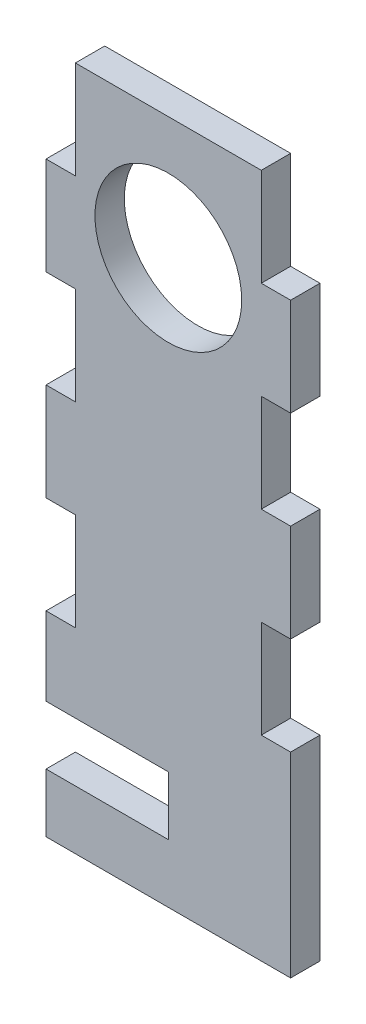
ISO-10303-21;
HEADER;
FILE_DESCRIPTION(('STEP AP214'),'2;1');
FILE_NAME('part.step','',(''),(''),'','','');
FILE_SCHEMA(('AUTOMOTIVE_DESIGN { 1 0 10303 214 1 1 1 1 }'));
ENDSEC;
DATA;
#1=APPLICATION_CONTEXT('core data for automotive mechanical design processes');
#2=APPLICATION_PROTOCOL_DEFINITION('international standard','automotive_design',2000,#1);
#3=PRODUCT_CONTEXT('',#1,'mechanical');
#4=PRODUCT('Part','Part','',(#3));
#5=PRODUCT_RELATED_PRODUCT_CATEGORY('part','',(#4));
#6=PRODUCT_DEFINITION_FORMATION('','',#4);
#7=PRODUCT_DEFINITION_CONTEXT('part definition',#1,'design');
#8=PRODUCT_DEFINITION('design','',#6,#7);
#9=PRODUCT_DEFINITION_SHAPE('','',#8);
#10=(LENGTH_UNIT() NAMED_UNIT(*) SI_UNIT(.MILLI.,.METRE.));
#11=(NAMED_UNIT(*) PLANE_ANGLE_UNIT() SI_UNIT($,.RADIAN.));
#12=(NAMED_UNIT(*) SI_UNIT($,.STERADIAN.) SOLID_ANGLE_UNIT());
#13=UNCERTAINTY_MEASURE_WITH_UNIT(LENGTH_MEASURE(1.E-05),#10,'distance_accuracy_value','');
#14=(GEOMETRIC_REPRESENTATION_CONTEXT(3) GLOBAL_UNCERTAINTY_ASSIGNED_CONTEXT((#13)) GLOBAL_UNIT_ASSIGNED_CONTEXT((#10,
#11,#12)) REPRESENTATION_CONTEXT('',''));
#15=CARTESIAN_POINT('',(0.,0.,0.));
#16=DIRECTION('',(0.,0.,1.));
#17=DIRECTION('',(1.,0.,0.));
#18=AXIS2_PLACEMENT_3D('',#15,#16,#17);
#19=CARTESIAN_POINT('',(-12.5,-35.,3.));
#20=DIRECTION('',(1.,0.,0.));
#21=DIRECTION('',(0.,0.,-1.));
#22=AXIS2_PLACEMENT_3D('',#19,#20,#21);
#23=PLANE('',#22);
#24=DIRECTION('',(0.,-1.,0.));
#25=VECTOR('',#24,1.);
#26=CARTESIAN_POINT('',(-12.5,-35.,0.));
#27=LINE('',#26,#25);
#28=CARTESIAN_POINT('',(-12.5,-15.,0.));
#29=VERTEX_POINT('',#28);
#30=CARTESIAN_POINT('',(-12.5,-23.,0.));
#31=VERTEX_POINT('',#30);
#32=EDGE_CURVE('E244',#29,#31,#27,.T.);
#33=ORIENTED_EDGE('',*,*,#32,.T.);
#34=DIRECTION('',(0.,0.,1.));
#35=VECTOR('',#34,1.);
#36=CARTESIAN_POINT('',(-12.5,-23.,0.));
#37=LINE('',#36,#35);
#38=CARTESIAN_POINT('',(-12.5,-23.,3.));
#39=VERTEX_POINT('',#38);
#40=EDGE_CURVE('E475',#31,#39,#37,.T.);
#41=ORIENTED_EDGE('',*,*,#40,.T.);
#42=DIRECTION('',(0.,-1.,0.));
#43=VECTOR('',#42,1.);
#44=CARTESIAN_POINT('',(-12.5,-35.,3.));
#45=LINE('',#44,#43);
#46=CARTESIAN_POINT('',(-12.5,-15.,3.));
#47=VERTEX_POINT('',#46);
#48=EDGE_CURVE('E277',#47,#39,#45,.T.);
#49=ORIENTED_EDGE('',*,*,#48,.F.);
#50=DIRECTION('',(0.,0.,1.));
#51=VECTOR('',#50,1.);
#52=CARTESIAN_POINT('',(-12.5,-15.,0.));
#53=LINE('',#52,#51);
#54=EDGE_CURVE('E331',#29,#47,#53,.T.);
#55=ORIENTED_EDGE('',*,*,#54,.F.);
#56=EDGE_LOOP('',(#33,#41,#49,#55));
#57=FACE_BOUND('',#56,.T.);
#58=ADVANCED_FACE('F35',(#57),#23,.F.);
#59=CARTESIAN_POINT('',(-12.5,25.,3.));
#60=VERTEX_POINT('',#59);
#61=CARTESIAN_POINT('',(-12.5,15.,3.));
#62=VERTEX_POINT('',#61);
#63=EDGE_CURVE('E270',#60,#62,#45,.T.);
#64=ORIENTED_EDGE('',*,*,#63,.F.);
#65=DIRECTION('',(0.,0.,1.));
#66=VECTOR('',#65,1.);
#67=CARTESIAN_POINT('',(-12.5,25.,0.));
#68=LINE('',#67,#66);
#69=CARTESIAN_POINT('',(-12.5,25.,0.));
#70=VERTEX_POINT('',#69);
#71=EDGE_CURVE('E391',#70,#60,#68,.T.);
#72=ORIENTED_EDGE('',*,*,#71,.F.);
#73=CARTESIAN_POINT('',(-12.5,15.,0.));
#74=VERTEX_POINT('',#73);
#75=EDGE_CURVE('E248',#70,#74,#27,.T.);
#76=ORIENTED_EDGE('',*,*,#75,.T.);
#77=DIRECTION('',(0.,0.,1.));
#78=VECTOR('',#77,1.);
#79=CARTESIAN_POINT('',(-12.5,15.,0.));
#80=LINE('',#79,#78);
#81=EDGE_CURVE('E418',#74,#62,#80,.T.);
#82=ORIENTED_EDGE('',*,*,#81,.T.);
#83=EDGE_LOOP('',(#64,#72,#76,#82));
#84=FACE_BOUND('',#83,.T.);
#85=ADVANCED_FACE('F509',(#84),#23,.F.);
#86=CARTESIAN_POINT('',(12.5,-35.,3.));
#87=DIRECTION('',(-1.,0.,0.));
#88=DIRECTION('',(0.,0.,1.));
#89=AXIS2_PLACEMENT_3D('',#86,#87,#88);
#90=PLANE('',#89);
#91=DIRECTION('',(0.,1.,0.));
#92=VECTOR('',#91,1.);
#93=CARTESIAN_POINT('',(12.5,-35.,0.));
#94=LINE('',#93,#92);
#95=CARTESIAN_POINT('',(12.5,-35.,0.));
#96=VERTEX_POINT('',#95);
#97=CARTESIAN_POINT('',(12.5,-15.,0.));
#98=VERTEX_POINT('',#97);
#99=EDGE_CURVE('E251',#96,#98,#94,.T.);
#100=ORIENTED_EDGE('',*,*,#99,.T.);
#101=DIRECTION('',(0.,0.,1.));
#102=VECTOR('',#101,1.);
#103=CARTESIAN_POINT('',(12.5,-15.,0.));
#104=LINE('',#103,#102);
#105=CARTESIAN_POINT('',(12.5,-15.,3.));
#106=VERTEX_POINT('',#105);
#107=EDGE_CURVE('E327',#98,#106,#104,.T.);
#108=ORIENTED_EDGE('',*,*,#107,.T.);
#109=DIRECTION('',(0.,1.,0.));
#110=VECTOR('',#109,1.);
#111=CARTESIAN_POINT('',(12.5,-35.,3.));
#112=LINE('',#111,#110);
#113=CARTESIAN_POINT('',(12.5,-35.,3.));
#114=VERTEX_POINT('',#113);
#115=EDGE_CURVE('E265',#114,#106,#112,.T.);
#116=ORIENTED_EDGE('',*,*,#115,.F.);
#117=DIRECTION('',(0.,0.,-1.));
#118=VECTOR('',#117,1.);
#119=CARTESIAN_POINT('',(12.5,-35.,3.));
#120=LINE('',#119,#118);
#121=EDGE_CURVE('E43',#114,#96,#120,.T.);
#122=ORIENTED_EDGE('',*,*,#121,.T.);
#123=EDGE_LOOP('',(#100,#108,#116,#122));
#124=FACE_BOUND('',#123,.T.);
#125=ADVANCED_FACE('F514',(#124),#90,.F.);
#126=CARTESIAN_POINT('',(-12.5,5.,3.));
#127=VERTEX_POINT('',#126);
#128=CARTESIAN_POINT('',(-12.5,-5.,3.));
#129=VERTEX_POINT('',#128);
#130=EDGE_CURVE('E275',#127,#129,#45,.T.);
#131=ORIENTED_EDGE('',*,*,#130,.F.);
#132=DIRECTION('',(0.,0.,1.));
#133=VECTOR('',#132,1.);
#134=CARTESIAN_POINT('',(-12.5,5.,0.));
#135=LINE('',#134,#133);
#136=CARTESIAN_POINT('',(-12.5,5.,0.));
#137=VERTEX_POINT('',#136);
#138=EDGE_CURVE('E429',#137,#127,#135,.T.);
#139=ORIENTED_EDGE('',*,*,#138,.F.);
#140=CARTESIAN_POINT('',(-12.5,-5.,0.));
#141=VERTEX_POINT('',#140);
#142=EDGE_CURVE('E247',#137,#141,#27,.T.);
#143=ORIENTED_EDGE('',*,*,#142,.T.);
#144=DIRECTION('',(0.,0.,1.));
#145=VECTOR('',#144,1.);
#146=CARTESIAN_POINT('',(-12.5,-5.,0.));
#147=LINE('',#146,#145);
#148=EDGE_CURVE('E322',#141,#129,#147,.T.);
#149=ORIENTED_EDGE('',*,*,#148,.T.);
#150=EDGE_LOOP('',(#131,#139,#143,#149));
#151=FACE_BOUND('',#150,.T.);
#152=ADVANCED_FACE('F329',(#151),#23,.F.);
#153=CARTESIAN_POINT('',(12.5,-5.,3.));
#154=VERTEX_POINT('',#153);
#155=CARTESIAN_POINT('',(12.5,5.,3.));
#156=VERTEX_POINT('',#155);
#157=EDGE_CURVE('E263',#154,#156,#112,.T.);
#158=ORIENTED_EDGE('',*,*,#157,.F.);
#159=DIRECTION('',(0.,0.,1.));
#160=VECTOR('',#159,1.);
#161=CARTESIAN_POINT('',(12.5,-5.,0.));
#162=LINE('',#161,#160);
#163=CARTESIAN_POINT('',(12.5,-5.,0.));
#164=VERTEX_POINT('',#163);
#165=EDGE_CURVE('E442',#164,#154,#162,.T.);
#166=ORIENTED_EDGE('',*,*,#165,.F.);
#167=CARTESIAN_POINT('',(12.5,5.,0.));
#168=VERTEX_POINT('',#167);
#169=EDGE_CURVE('E280',#164,#168,#94,.T.);
#170=ORIENTED_EDGE('',*,*,#169,.T.);
#171=DIRECTION('',(0.,0.,1.));
#172=VECTOR('',#171,1.);
#173=CARTESIAN_POINT('',(12.5,5.,0.));
#174=LINE('',#173,#172);
#175=EDGE_CURVE('E360',#168,#156,#174,.T.);
#176=ORIENTED_EDGE('',*,*,#175,.T.);
#177=EDGE_LOOP('',(#158,#166,#170,#176));
#178=FACE_BOUND('',#177,.T.);
#179=ADVANCED_FACE('F520',(#178),#90,.F.);
#180=CARTESIAN_POINT('',(12.5,15.,3.));
#181=VERTEX_POINT('',#180);
#182=CARTESIAN_POINT('',(12.5,25.,3.));
#183=VERTEX_POINT('',#182);
#184=EDGE_CURVE('E259',#181,#183,#112,.T.);
#185=ORIENTED_EDGE('',*,*,#184,.F.);
#186=DIRECTION('',(0.,0.,1.));
#187=VECTOR('',#186,1.);
#188=CARTESIAN_POINT('',(12.5,15.,0.));
#189=LINE('',#188,#187);
#190=CARTESIAN_POINT('',(12.5,15.,0.));
#191=VERTEX_POINT('',#190);
#192=EDGE_CURVE('E351',#191,#181,#189,.T.);
#193=ORIENTED_EDGE('',*,*,#192,.F.);
#194=CARTESIAN_POINT('',(12.5,25.,0.));
#195=VERTEX_POINT('',#194);
#196=EDGE_CURVE('E281',#191,#195,#94,.T.);
#197=ORIENTED_EDGE('',*,*,#196,.T.);
#198=DIRECTION('',(0.,0.,1.));
#199=VECTOR('',#198,1.);
#200=CARTESIAN_POINT('',(12.5,25.,0.));
#201=LINE('',#200,#199);
#202=EDGE_CURVE('E283',#195,#183,#201,.T.);
#203=ORIENTED_EDGE('',*,*,#202,.T.);
#204=EDGE_LOOP('',(#185,#193,#197,#203));
#205=FACE_BOUND('',#204,.T.);
#206=ADVANCED_FACE('F37',(#205),#90,.F.);
#207=CARTESIAN_POINT('',(-12.5,35.,3.));
#208=DIRECTION('',(0.,-1.,0.));
#209=DIRECTION('',(0.,0.,-1.));
#210=AXIS2_PLACEMENT_3D('',#207,#208,#209);
#211=PLANE('',#210);
#212=DIRECTION('',(-1.,0.,0.));
#213=VECTOR('',#212,1.);
#214=CARTESIAN_POINT('',(-12.5,35.,0.));
#215=LINE('',#214,#213);
#216=CARTESIAN_POINT('',(9.5,35.,0.));
#217=VERTEX_POINT('',#216);
#218=CARTESIAN_POINT('',(-9.5,35.,0.));
#219=VERTEX_POINT('',#218);
#220=EDGE_CURVE('E245',#217,#219,#215,.T.);
#221=ORIENTED_EDGE('',*,*,#220,.T.);
#222=DIRECTION('',(0.,0.,1.));
#223=VECTOR('',#222,1.);
#224=CARTESIAN_POINT('',(-9.5,35.,0.));
#225=LINE('',#224,#223);
#226=CARTESIAN_POINT('',(-9.5,35.,3.));
#227=VERTEX_POINT('',#226);
#228=EDGE_CURVE('E404',#219,#227,#225,.T.);
#229=ORIENTED_EDGE('',*,*,#228,.T.);
#230=DIRECTION('',(-1.,0.,0.));
#231=VECTOR('',#230,1.);
#232=CARTESIAN_POINT('',(-12.5,35.,3.));
#233=LINE('',#232,#231);
#234=CARTESIAN_POINT('',(9.5,35.,3.));
#235=VERTEX_POINT('',#234);
#236=EDGE_CURVE('E299',#235,#227,#233,.T.);
#237=ORIENTED_EDGE('',*,*,#236,.F.);
#238=DIRECTION('',(0.,0.,1.));
#239=VECTOR('',#238,1.);
#240=CARTESIAN_POINT('',(9.5,35.,0.));
#241=LINE('',#240,#239);
#242=EDGE_CURVE('E292',#217,#235,#241,.T.);
#243=ORIENTED_EDGE('',*,*,#242,.F.);
#244=EDGE_LOOP('',(#221,#229,#237,#243));
#245=FACE_BOUND('',#244,.T.);
#246=ADVANCED_FACE('F387',(#245),#211,.F.);
#247=CARTESIAN_POINT('',(-12.5,-29.,3.));
#248=VERTEX_POINT('',#247);
#249=CARTESIAN_POINT('',(-12.5,-35.,3.));
#250=VERTEX_POINT('',#249);
#251=EDGE_CURVE('E235',#248,#250,#45,.T.);
#252=ORIENTED_EDGE('',*,*,#251,.F.);
#253=DIRECTION('',(0.,0.,1.));
#254=VECTOR('',#253,1.);
#255=CARTESIAN_POINT('',(-12.5,-29.,0.));
#256=LINE('',#255,#254);
#257=CARTESIAN_POINT('',(-12.5,-29.,0.));
#258=VERTEX_POINT('',#257);
#259=EDGE_CURVE('E223',#258,#248,#256,.T.);
#260=ORIENTED_EDGE('',*,*,#259,.F.);
#261=CARTESIAN_POINT('',(-12.5,-35.,0.));
#262=VERTEX_POINT('',#261);
#263=EDGE_CURVE('E234',#258,#262,#27,.T.);
#264=ORIENTED_EDGE('',*,*,#263,.T.);
#265=DIRECTION('',(0.,0.,-1.));
#266=VECTOR('',#265,1.);
#267=CARTESIAN_POINT('',(-12.5,-35.,3.));
#268=LINE('',#267,#266);
#269=EDGE_CURVE('E11',#250,#262,#268,.T.);
#270=ORIENTED_EDGE('',*,*,#269,.F.);
#271=EDGE_LOOP('',(#252,#260,#264,#270));
#272=FACE_BOUND('',#271,.T.);
#273=ADVANCED_FACE('F232',(#272),#23,.F.);
#274=CARTESIAN_POINT('',(-12.5,-35.,3.));
#275=DIRECTION('',(0.,1.,0.));
#276=DIRECTION('',(0.,0.,1.));
#277=AXIS2_PLACEMENT_3D('',#274,#275,#276);
#278=PLANE('',#277);
#279=DIRECTION('',(1.,0.,0.));
#280=VECTOR('',#279,1.);
#281=CARTESIAN_POINT('',(-12.5,-35.,0.));
#282=LINE('',#281,#280);
#283=EDGE_CURVE('E243',#262,#96,#282,.T.);
#284=ORIENTED_EDGE('',*,*,#283,.T.);
#285=ORIENTED_EDGE('',*,*,#121,.F.);
#286=DIRECTION('',(1.,0.,0.));
#287=VECTOR('',#286,1.);
#288=CARTESIAN_POINT('',(-12.5,-35.,3.));
#289=LINE('',#288,#287);
#290=EDGE_CURVE('E266',#250,#114,#289,.T.);
#291=ORIENTED_EDGE('',*,*,#290,.F.);
#292=ORIENTED_EDGE('',*,*,#269,.T.);
#293=EDGE_LOOP('',(#284,#285,#291,#292));
#294=FACE_BOUND('',#293,.T.);
#295=ADVANCED_FACE('F499',(#294),#278,.F.);
#296=CARTESIAN_POINT('',(0.,0.,3.));
#297=DIRECTION('',(0.,0.,-1.));
#298=DIRECTION('',(-1.,0.,0.));
#299=AXIS2_PLACEMENT_3D('',#296,#297,#298);
#300=PLANE('',#299);
#301=CARTESIAN_POINT('',(0.,22.5,3.));
#302=DIRECTION('',(0.,0.,1.));
#303=DIRECTION('',(1.,0.,0.));
#304=AXIS2_PLACEMENT_3D('',#301,#302,#303);
#305=CIRCLE('',#304,7.5);
#306=CARTESIAN_POINT('',(7.5,22.5,3.));
#307=VERTEX_POINT('',#306);
#308=EDGE_CURVE('E478',#307,#307,#305,.T.);
#309=ORIENTED_EDGE('',*,*,#308,.F.);
#310=EDGE_LOOP('',(#309));
#311=FACE_BOUND('',#310,.T.);
#312=ORIENTED_EDGE('',*,*,#48,.T.);
#313=DIRECTION('',(-1.,0.,0.));
#314=VECTOR('',#313,1.);
#315=CARTESIAN_POINT('',(-12.5,-23.,3.));
#316=LINE('',#315,#314);
#317=CARTESIAN_POINT('',(0.,-23.,3.));
#318=VERTEX_POINT('',#317);
#319=EDGE_CURVE('E228',#318,#39,#316,.T.);
#320=ORIENTED_EDGE('',*,*,#319,.F.);
#321=DIRECTION('',(0.,1.,0.));
#322=VECTOR('',#321,1.);
#323=CARTESIAN_POINT('',(0.,-23.,3.));
#324=LINE('',#323,#322);
#325=CARTESIAN_POINT('',(0.,-29.,3.));
#326=VERTEX_POINT('',#325);
#327=EDGE_CURVE('E737',#326,#318,#324,.T.);
#328=ORIENTED_EDGE('',*,*,#327,.F.);
#329=DIRECTION('',(1.,0.,0.));
#330=VECTOR('',#329,1.);
#331=CARTESIAN_POINT('',(-12.5,-29.,3.));
#332=LINE('',#331,#330);
#333=EDGE_CURVE('E738',#248,#326,#332,.T.);
#334=ORIENTED_EDGE('',*,*,#333,.F.);
#335=ORIENTED_EDGE('',*,*,#251,.T.);
#336=ORIENTED_EDGE('',*,*,#290,.T.);
#337=ORIENTED_EDGE('',*,*,#115,.T.);
#338=DIRECTION('',(1.,0.,0.));
#339=VECTOR('',#338,1.);
#340=CARTESIAN_POINT('',(12.5,-15.,3.));
#341=LINE('',#340,#339);
#342=CARTESIAN_POINT('',(9.50000000000001,-15.,3.));
#343=VERTEX_POINT('',#342);
#344=EDGE_CURVE('E436',#343,#106,#341,.T.);
#345=ORIENTED_EDGE('',*,*,#344,.F.);
#346=DIRECTION('',(0.,-1.,0.));
#347=VECTOR('',#346,1.);
#348=CARTESIAN_POINT('',(9.50000000000001,-5.,3.));
#349=LINE('',#348,#347);
#350=CARTESIAN_POINT('',(9.50000000000001,-5.,3.));
#351=VERTEX_POINT('',#350);
#352=EDGE_CURVE('E445',#351,#343,#349,.T.);
#353=ORIENTED_EDGE('',*,*,#352,.F.);
#354=DIRECTION('',(-1.,0.,0.));
#355=VECTOR('',#354,1.);
#356=CARTESIAN_POINT('',(12.5,-5.,3.));
#357=LINE('',#356,#355);
#358=EDGE_CURVE('E426',#154,#351,#357,.T.);
#359=ORIENTED_EDGE('',*,*,#358,.F.);
#360=ORIENTED_EDGE('',*,*,#157,.T.);
#361=DIRECTION('',(1.,0.,0.));
#362=VECTOR('',#361,1.);
#363=CARTESIAN_POINT('',(12.5,5.,3.));
#364=LINE('',#363,#362);
#365=CARTESIAN_POINT('',(9.50000000000001,5.,3.));
#366=VERTEX_POINT('',#365);
#367=EDGE_CURVE('E345',#366,#156,#364,.T.);
#368=ORIENTED_EDGE('',*,*,#367,.F.);
#369=DIRECTION('',(0.,-1.,0.));
#370=VECTOR('',#369,1.);
#371=CARTESIAN_POINT('',(9.5,15.,3.));
#372=LINE('',#371,#370);
#373=CARTESIAN_POINT('',(9.5,15.,3.));
#374=VERTEX_POINT('',#373);
#375=EDGE_CURVE('E355',#374,#366,#372,.T.);
#376=ORIENTED_EDGE('',*,*,#375,.F.);
#377=DIRECTION('',(-1.,0.,0.));
#378=VECTOR('',#377,1.);
#379=CARTESIAN_POINT('',(12.5,15.,3.));
#380=LINE('',#379,#378);
#381=EDGE_CURVE('E352',#181,#374,#380,.T.);
#382=ORIENTED_EDGE('',*,*,#381,.F.);
#383=ORIENTED_EDGE('',*,*,#184,.T.);
#384=DIRECTION('',(1.,0.,0.));
#385=VECTOR('',#384,1.);
#386=CARTESIAN_POINT('',(12.5,25.,3.));
#387=LINE('',#386,#385);
#388=CARTESIAN_POINT('',(9.5,25.,3.));
#389=VERTEX_POINT('',#388);
#390=EDGE_CURVE('E295',#389,#183,#387,.T.);
#391=ORIENTED_EDGE('',*,*,#390,.F.);
#392=DIRECTION('',(0.,-1.,0.));
#393=VECTOR('',#392,1.);
#394=CARTESIAN_POINT('',(9.5,35.,3.));
#395=LINE('',#394,#393);
#396=EDGE_CURVE('E363',#235,#389,#395,.T.);
#397=ORIENTED_EDGE('',*,*,#396,.F.);
#398=ORIENTED_EDGE('',*,*,#236,.T.);
#399=DIRECTION('',(0.,1.,0.));
#400=VECTOR('',#399,1.);
#401=CARTESIAN_POINT('',(-9.5,35.,3.));
#402=LINE('',#401,#400);
#403=CARTESIAN_POINT('',(-9.5,25.,3.));
#404=VERTEX_POINT('',#403);
#405=EDGE_CURVE('E395',#404,#227,#402,.T.);
#406=ORIENTED_EDGE('',*,*,#405,.F.);
#407=DIRECTION('',(1.,0.,0.));
#408=VECTOR('',#407,1.);
#409=CARTESIAN_POINT('',(-12.5,25.,3.));
#410=LINE('',#409,#408);
#411=EDGE_CURVE('E399',#60,#404,#410,.T.);
#412=ORIENTED_EDGE('',*,*,#411,.F.);
#413=ORIENTED_EDGE('',*,*,#63,.T.);
#414=DIRECTION('',(-1.,0.,0.));
#415=VECTOR('',#414,1.);
#416=CARTESIAN_POINT('',(-12.5,15.,3.));
#417=LINE('',#416,#415);
#418=CARTESIAN_POINT('',(-9.5,15.,3.));
#419=VERTEX_POINT('',#418);
#420=EDGE_CURVE('E406',#419,#62,#417,.T.);
#421=ORIENTED_EDGE('',*,*,#420,.F.);
#422=DIRECTION('',(0.,1.,0.));
#423=VECTOR('',#422,1.);
#424=CARTESIAN_POINT('',(-9.5,15.,3.));
#425=LINE('',#424,#423);
#426=CARTESIAN_POINT('',(-9.50000000000001,5.,3.));
#427=VERTEX_POINT('',#426);
#428=EDGE_CURVE('E412',#427,#419,#425,.T.);
#429=ORIENTED_EDGE('',*,*,#428,.F.);
#430=DIRECTION('',(1.,0.,0.));
#431=VECTOR('',#430,1.);
#432=CARTESIAN_POINT('',(-12.5,5.,3.));
#433=LINE('',#432,#431);
#434=EDGE_CURVE('E314',#127,#427,#433,.T.);
#435=ORIENTED_EDGE('',*,*,#434,.F.);
#436=ORIENTED_EDGE('',*,*,#130,.T.);
#437=DIRECTION('',(-1.,0.,0.));
#438=VECTOR('',#437,1.);
#439=CARTESIAN_POINT('',(-12.5,-5.,3.));
#440=LINE('',#439,#438);
#441=CARTESIAN_POINT('',(-9.50000000000001,-5.,3.));
#442=VERTEX_POINT('',#441);
#443=EDGE_CURVE('E311',#442,#129,#440,.T.);
#444=ORIENTED_EDGE('',*,*,#443,.F.);
#445=DIRECTION('',(0.,1.,0.));
#446=VECTOR('',#445,1.);
#447=CARTESIAN_POINT('',(-9.50000000000001,-5.,3.));
#448=LINE('',#447,#446);
#449=CARTESIAN_POINT('',(-9.50000000000001,-15.,3.));
#450=VERTEX_POINT('',#449);
#451=EDGE_CURVE('E457',#450,#442,#448,.T.);
#452=ORIENTED_EDGE('',*,*,#451,.F.);
#453=DIRECTION('',(1.,0.,0.));
#454=VECTOR('',#453,1.);
#455=CARTESIAN_POINT('',(-12.5,-15.,3.));
#456=LINE('',#455,#454);
#457=EDGE_CURVE('E326',#47,#450,#456,.T.);
#458=ORIENTED_EDGE('',*,*,#457,.F.);
#459=EDGE_LOOP('',(#312,#320,#328,#334,#335,#336,#337,#345,#353,#359,#360,#368,#376,#382,#383,
#391,#397,#398,#406,#412,#413,#421,#429,#435,#436,#444,#452,#458));
#460=FACE_BOUND('',#459,.T.);
#461=ADVANCED_FACE('F309',(#311,#460),#300,.F.);
#462=CARTESIAN_POINT('',(0.,0.,0.));
#463=DIRECTION('',(0.,0.,-1.));
#464=DIRECTION('',(-1.,0.,0.));
#465=AXIS2_PLACEMENT_3D('',#462,#463,#464);
#466=PLANE('',#465);
#467=DIRECTION('',(-1.,0.,0.));
#468=VECTOR('',#467,1.);
#469=CARTESIAN_POINT('',(-12.5,-23.,0.));
#470=LINE('',#469,#468);
#471=CARTESIAN_POINT('',(0.,-23.,0.));
#472=VERTEX_POINT('',#471);
#473=EDGE_CURVE('E236',#472,#31,#470,.T.);
#474=ORIENTED_EDGE('',*,*,#473,.T.);
#475=ORIENTED_EDGE('',*,*,#32,.F.);
#476=DIRECTION('',(1.,0.,0.));
#477=VECTOR('',#476,1.);
#478=CARTESIAN_POINT('',(-12.5,-15.,0.));
#479=LINE('',#478,#477);
#480=CARTESIAN_POINT('',(-9.50000000000001,-15.,0.));
#481=VERTEX_POINT('',#480);
#482=EDGE_CURVE('E337',#29,#481,#479,.T.);
#483=ORIENTED_EDGE('',*,*,#482,.T.);
#484=DIRECTION('',(0.,1.,0.));
#485=VECTOR('',#484,1.);
#486=CARTESIAN_POINT('',(-9.50000000000001,-5.,0.));
#487=LINE('',#486,#485);
#488=CARTESIAN_POINT('',(-9.50000000000001,-5.,0.));
#489=VERTEX_POINT('',#488);
#490=EDGE_CURVE('E332',#481,#489,#487,.T.);
#491=ORIENTED_EDGE('',*,*,#490,.T.);
#492=DIRECTION('',(-1.,0.,0.));
#493=VECTOR('',#492,1.);
#494=CARTESIAN_POINT('',(-12.5,-5.,0.));
#495=LINE('',#494,#493);
#496=EDGE_CURVE('E455',#489,#141,#495,.T.);
#497=ORIENTED_EDGE('',*,*,#496,.T.);
#498=ORIENTED_EDGE('',*,*,#142,.F.);
#499=DIRECTION('',(1.,0.,0.));
#500=VECTOR('',#499,1.);
#501=CARTESIAN_POINT('',(-12.5,5.,0.));
#502=LINE('',#501,#500);
#503=CARTESIAN_POINT('',(-9.50000000000001,5.,0.));
#504=VERTEX_POINT('',#503);
#505=EDGE_CURVE('E411',#137,#504,#502,.T.);
#506=ORIENTED_EDGE('',*,*,#505,.T.);
#507=DIRECTION('',(0.,1.,0.));
#508=VECTOR('',#507,1.);
#509=CARTESIAN_POINT('',(-9.5,15.,0.));
#510=LINE('',#509,#508);
#511=CARTESIAN_POINT('',(-9.5,15.,0.));
#512=VERTEX_POINT('',#511);
#513=EDGE_CURVE('E415',#504,#512,#510,.T.);
#514=ORIENTED_EDGE('',*,*,#513,.T.);
#515=DIRECTION('',(-1.,0.,0.));
#516=VECTOR('',#515,1.);
#517=CARTESIAN_POINT('',(-12.5,15.,0.));
#518=LINE('',#517,#516);
#519=EDGE_CURVE('E408',#512,#74,#518,.T.);
#520=ORIENTED_EDGE('',*,*,#519,.T.);
#521=ORIENTED_EDGE('',*,*,#75,.F.);
#522=DIRECTION('',(1.,0.,0.));
#523=VECTOR('',#522,1.);
#524=CARTESIAN_POINT('',(-12.5,25.,0.));
#525=LINE('',#524,#523);
#526=CARTESIAN_POINT('',(-9.5,25.,0.));
#527=VERTEX_POINT('',#526);
#528=EDGE_CURVE('E390',#70,#527,#525,.T.);
#529=ORIENTED_EDGE('',*,*,#528,.T.);
#530=DIRECTION('',(0.,1.,0.));
#531=VECTOR('',#530,1.);
#532=CARTESIAN_POINT('',(-9.5,35.,0.));
#533=LINE('',#532,#531);
#534=EDGE_CURVE('E58',#527,#219,#533,.T.);
#535=ORIENTED_EDGE('',*,*,#534,.T.);
#536=ORIENTED_EDGE('',*,*,#220,.F.);
#537=DIRECTION('',(0.,-1.,0.));
#538=VECTOR('',#537,1.);
#539=CARTESIAN_POINT('',(9.5,35.,0.));
#540=LINE('',#539,#538);
#541=CARTESIAN_POINT('',(9.50000000000001,25.,0.));
#542=VERTEX_POINT('',#541);
#543=EDGE_CURVE('E369',#217,#542,#540,.T.);
#544=ORIENTED_EDGE('',*,*,#543,.T.);
#545=DIRECTION('',(1.,0.,0.));
#546=VECTOR('',#545,1.);
#547=CARTESIAN_POINT('',(12.5,25.,0.));
#548=LINE('',#547,#546);
#549=EDGE_CURVE('E298',#542,#195,#548,.T.);
#550=ORIENTED_EDGE('',*,*,#549,.T.);
#551=ORIENTED_EDGE('',*,*,#196,.F.);
#552=DIRECTION('',(-1.,0.,0.));
#553=VECTOR('',#552,1.);
#554=CARTESIAN_POINT('',(12.5,15.,0.));
#555=LINE('',#554,#553);
#556=CARTESIAN_POINT('',(9.5,15.,0.));
#557=VERTEX_POINT('',#556);
#558=EDGE_CURVE('E341',#191,#557,#555,.T.);
#559=ORIENTED_EDGE('',*,*,#558,.T.);
#560=DIRECTION('',(0.,-1.,0.));
#561=VECTOR('',#560,1.);
#562=CARTESIAN_POINT('',(9.5,15.,0.));
#563=LINE('',#562,#561);
#564=CARTESIAN_POINT('',(9.50000000000001,5.,0.));
#565=VERTEX_POINT('',#564);
#566=EDGE_CURVE('E344',#557,#565,#563,.T.);
#567=ORIENTED_EDGE('',*,*,#566,.T.);
#568=DIRECTION('',(1.,0.,0.));
#569=VECTOR('',#568,1.);
#570=CARTESIAN_POINT('',(12.5,5.,0.));
#571=LINE('',#570,#569);
#572=EDGE_CURVE('E348',#565,#168,#571,.T.);
#573=ORIENTED_EDGE('',*,*,#572,.T.);
#574=ORIENTED_EDGE('',*,*,#169,.F.);
#575=DIRECTION('',(-1.,0.,0.));
#576=VECTOR('',#575,1.);
#577=CARTESIAN_POINT('',(12.5,-5.,0.));
#578=LINE('',#577,#576);
#579=CARTESIAN_POINT('',(9.50000000000001,-5.,0.));
#580=VERTEX_POINT('',#579);
#581=EDGE_CURVE('E432',#164,#580,#578,.T.);
#582=ORIENTED_EDGE('',*,*,#581,.T.);
#583=DIRECTION('',(0.,-1.,0.));
#584=VECTOR('',#583,1.);
#585=CARTESIAN_POINT('',(9.50000000000001,-5.,0.));
#586=LINE('',#585,#584);
#587=CARTESIAN_POINT('',(9.50000000000001,-15.,0.));
#588=VERTEX_POINT('',#587);
#589=EDGE_CURVE('E435',#580,#588,#586,.T.);
#590=ORIENTED_EDGE('',*,*,#589,.T.);
#591=DIRECTION('',(1.,0.,0.));
#592=VECTOR('',#591,1.);
#593=CARTESIAN_POINT('',(12.5,-15.,0.));
#594=LINE('',#593,#592);
#595=EDGE_CURVE('E439',#588,#98,#594,.T.);
#596=ORIENTED_EDGE('',*,*,#595,.T.);
#597=ORIENTED_EDGE('',*,*,#99,.F.);
#598=ORIENTED_EDGE('',*,*,#283,.F.);
#599=ORIENTED_EDGE('',*,*,#263,.F.);
#600=DIRECTION('',(1.,0.,0.));
#601=VECTOR('',#600,1.);
#602=CARTESIAN_POINT('',(-12.5,-29.,0.));
#603=LINE('',#602,#601);
#604=CARTESIAN_POINT('',(0.,-29.,0.));
#605=VERTEX_POINT('',#604);
#606=EDGE_CURVE('E219',#258,#605,#603,.T.);
#607=ORIENTED_EDGE('',*,*,#606,.T.);
#608=DIRECTION('',(0.,1.,0.));
#609=VECTOR('',#608,1.);
#610=CARTESIAN_POINT('',(0.,-23.,0.));
#611=LINE('',#610,#609);
#612=EDGE_CURVE('E50',#605,#472,#611,.T.);
#613=ORIENTED_EDGE('',*,*,#612,.T.);
#614=EDGE_LOOP('',(#474,#475,#483,#491,#497,#498,#506,#514,#520,#521,#529,#535,#536,#544,#550,
#551,#559,#567,#573,#574,#582,#590,#596,#597,#598,#599,#607,#613));
#615=FACE_BOUND('',#614,.T.);
#616=CARTESIAN_POINT('',(0.,22.5,0.));
#617=DIRECTION('',(0.,0.,1.));
#618=DIRECTION('',(1.,0.,0.));
#619=AXIS2_PLACEMENT_3D('',#616,#617,#618);
#620=CIRCLE('',#619,7.5);
#621=CARTESIAN_POINT('',(7.5,22.5,0.));
#622=VERTEX_POINT('',#621);
#623=EDGE_CURVE('E402',#622,#622,#620,.T.);
#624=ORIENTED_EDGE('',*,*,#623,.T.);
#625=EDGE_LOOP('',(#624));
#626=FACE_BOUND('',#625,.T.);
#627=ADVANCED_FACE('F240',(#615,#626),#466,.T.);
#628=CARTESIAN_POINT('',(12.5,25.,0.));
#629=DIRECTION('',(0.,-1.,0.));
#630=DIRECTION('',(0.,0.,-1.));
#631=AXIS2_PLACEMENT_3D('',#628,#629,#630);
#632=PLANE('',#631);
#633=ORIENTED_EDGE('',*,*,#390,.T.);
#634=ORIENTED_EDGE('',*,*,#202,.F.);
#635=ORIENTED_EDGE('',*,*,#549,.F.);
#636=DIRECTION('',(0.,0.,1.));
#637=VECTOR('',#636,1.);
#638=CARTESIAN_POINT('',(9.5,25.,0.));
#639=LINE('',#638,#637);
#640=EDGE_CURVE('E289',#542,#389,#639,.T.);
#641=ORIENTED_EDGE('',*,*,#640,.T.);
#642=EDGE_LOOP('',(#633,#634,#635,#641));
#643=FACE_BOUND('',#642,.T.);
#644=ADVANCED_FACE('F379',(#643),#632,.F.);
#645=CARTESIAN_POINT('',(9.5,35.,0.));
#646=DIRECTION('',(-1.,0.,0.));
#647=DIRECTION('',(0.,-1.,0.));
#648=AXIS2_PLACEMENT_3D('',#645,#646,#647);
#649=PLANE('',#648);
#650=ORIENTED_EDGE('',*,*,#396,.T.);
#651=ORIENTED_EDGE('',*,*,#640,.F.);
#652=ORIENTED_EDGE('',*,*,#543,.F.);
#653=ORIENTED_EDGE('',*,*,#242,.T.);
#654=EDGE_LOOP('',(#650,#651,#652,#653));
#655=FACE_BOUND('',#654,.T.);
#656=ADVANCED_FACE('F384',(#655),#649,.F.);
#657=CARTESIAN_POINT('',(12.5,5.,0.));
#658=DIRECTION('',(0.,-1.,0.));
#659=DIRECTION('',(0.,0.,-1.));
#660=AXIS2_PLACEMENT_3D('',#657,#658,#659);
#661=PLANE('',#660);
#662=ORIENTED_EDGE('',*,*,#367,.T.);
#663=ORIENTED_EDGE('',*,*,#175,.F.);
#664=ORIENTED_EDGE('',*,*,#572,.F.);
#665=DIRECTION('',(0.,0.,1.));
#666=VECTOR('',#665,1.);
#667=CARTESIAN_POINT('',(9.50000000000001,5.,0.));
#668=LINE('',#667,#666);
#669=EDGE_CURVE('E364',#565,#366,#668,.T.);
#670=ORIENTED_EDGE('',*,*,#669,.T.);
#671=EDGE_LOOP('',(#662,#663,#664,#670));
#672=FACE_BOUND('',#671,.T.);
#673=ADVANCED_FACE('F571',(#672),#661,.F.);
#674=CARTESIAN_POINT('',(9.5,15.,0.));
#675=DIRECTION('',(-1.,0.,0.));
#676=DIRECTION('',(0.,-1.,0.));
#677=AXIS2_PLACEMENT_3D('',#674,#675,#676);
#678=PLANE('',#677);
#679=ORIENTED_EDGE('',*,*,#375,.T.);
#680=ORIENTED_EDGE('',*,*,#669,.F.);
#681=ORIENTED_EDGE('',*,*,#566,.F.);
#682=DIRECTION('',(0.,0.,1.));
#683=VECTOR('',#682,1.);
#684=CARTESIAN_POINT('',(9.5,15.,0.));
#685=LINE('',#684,#683);
#686=EDGE_CURVE('E366',#557,#374,#685,.T.);
#687=ORIENTED_EDGE('',*,*,#686,.T.);
#688=EDGE_LOOP('',(#679,#680,#681,#687));
#689=FACE_BOUND('',#688,.T.);
#690=ADVANCED_FACE('F579',(#689),#678,.F.);
#691=CARTESIAN_POINT('',(12.5,15.,0.));
#692=DIRECTION('',(0.,1.,0.));
#693=DIRECTION('',(0.,0.,1.));
#694=AXIS2_PLACEMENT_3D('',#691,#692,#693);
#695=PLANE('',#694);
#696=ORIENTED_EDGE('',*,*,#381,.T.);
#697=ORIENTED_EDGE('',*,*,#686,.F.);
#698=ORIENTED_EDGE('',*,*,#558,.F.);
#699=ORIENTED_EDGE('',*,*,#192,.T.);
#700=EDGE_LOOP('',(#696,#697,#698,#699));
#701=FACE_BOUND('',#700,.T.);
#702=ADVANCED_FACE('F589',(#701),#695,.F.);
#703=CARTESIAN_POINT('',(-12.5,-5.,0.));
#704=DIRECTION('',(0.,1.,0.));
#705=DIRECTION('',(0.,0.,1.));
#706=AXIS2_PLACEMENT_3D('',#703,#704,#705);
#707=PLANE('',#706);
#708=ORIENTED_EDGE('',*,*,#443,.T.);
#709=ORIENTED_EDGE('',*,*,#148,.F.);
#710=ORIENTED_EDGE('',*,*,#496,.F.);
#711=DIRECTION('',(0.,0.,1.));
#712=VECTOR('',#711,1.);
#713=CARTESIAN_POINT('',(-9.50000000000001,-5.,0.));
#714=LINE('',#713,#712);
#715=EDGE_CURVE('E324',#489,#442,#714,.T.);
#716=ORIENTED_EDGE('',*,*,#715,.T.);
#717=EDGE_LOOP('',(#708,#709,#710,#716));
#718=FACE_BOUND('',#717,.T.);
#719=ADVANCED_FACE('F320',(#718),#707,.F.);
#720=CARTESIAN_POINT('',(-9.50000000000001,-5.,0.));
#721=DIRECTION('',(1.,0.,0.));
#722=DIRECTION('',(0.,1.,0.));
#723=AXIS2_PLACEMENT_3D('',#720,#721,#722);
#724=PLANE('',#723);
#725=ORIENTED_EDGE('',*,*,#451,.T.);
#726=ORIENTED_EDGE('',*,*,#715,.F.);
#727=ORIENTED_EDGE('',*,*,#490,.F.);
#728=DIRECTION('',(0.,0.,1.));
#729=VECTOR('',#728,1.);
#730=CARTESIAN_POINT('',(-9.50000000000001,-15.,0.));
#731=LINE('',#730,#729);
#732=EDGE_CURVE('E334',#481,#450,#731,.T.);
#733=ORIENTED_EDGE('',*,*,#732,.T.);
#734=EDGE_LOOP('',(#725,#726,#727,#733));
#735=FACE_BOUND('',#734,.T.);
#736=ADVANCED_FACE('F465',(#735),#724,.F.);
#737=CARTESIAN_POINT('',(-12.5,-15.,0.));
#738=DIRECTION('',(0.,-1.,0.));
#739=DIRECTION('',(0.,0.,-1.));
#740=AXIS2_PLACEMENT_3D('',#737,#738,#739);
#741=PLANE('',#740);
#742=ORIENTED_EDGE('',*,*,#457,.T.);
#743=ORIENTED_EDGE('',*,*,#732,.F.);
#744=ORIENTED_EDGE('',*,*,#482,.F.);
#745=ORIENTED_EDGE('',*,*,#54,.T.);
#746=EDGE_LOOP('',(#742,#743,#744,#745));
#747=FACE_BOUND('',#746,.T.);
#748=ADVANCED_FACE('F468',(#747),#741,.F.);
#749=CARTESIAN_POINT('',(12.5,-15.,0.));
#750=DIRECTION('',(0.,-1.,0.));
#751=DIRECTION('',(1.,0.,0.));
#752=AXIS2_PLACEMENT_3D('',#749,#750,#751);
#753=PLANE('',#752);
#754=ORIENTED_EDGE('',*,*,#344,.T.);
#755=ORIENTED_EDGE('',*,*,#107,.F.);
#756=ORIENTED_EDGE('',*,*,#595,.F.);
#757=DIRECTION('',(0.,0.,1.));
#758=VECTOR('',#757,1.);
#759=CARTESIAN_POINT('',(9.50000000000001,-15.,0.));
#760=LINE('',#759,#758);
#761=EDGE_CURVE('E450',#588,#343,#760,.T.);
#762=ORIENTED_EDGE('',*,*,#761,.T.);
#763=EDGE_LOOP('',(#754,#755,#756,#762));
#764=FACE_BOUND('',#763,.T.);
#765=ADVANCED_FACE('F623',(#764),#753,.F.);
#766=CARTESIAN_POINT('',(9.50000000000001,-5.,0.));
#767=DIRECTION('',(-1.,0.,0.));
#768=DIRECTION('',(0.,-1.,0.));
#769=AXIS2_PLACEMENT_3D('',#766,#767,#768);
#770=PLANE('',#769);
#771=ORIENTED_EDGE('',*,*,#352,.T.);
#772=ORIENTED_EDGE('',*,*,#761,.F.);
#773=ORIENTED_EDGE('',*,*,#589,.F.);
#774=DIRECTION('',(0.,0.,1.));
#775=VECTOR('',#774,1.);
#776=CARTESIAN_POINT('',(9.50000000000001,-5.,0.));
#777=LINE('',#776,#775);
#778=EDGE_CURVE('E452',#580,#351,#777,.T.);
#779=ORIENTED_EDGE('',*,*,#778,.T.);
#780=EDGE_LOOP('',(#771,#772,#773,#779));
#781=FACE_BOUND('',#780,.T.);
#782=ADVANCED_FACE('F632',(#781),#770,.F.);
#783=CARTESIAN_POINT('',(12.5,-5.,0.));
#784=DIRECTION('',(0.,1.,0.));
#785=DIRECTION('',(-1.,0.,0.));
#786=AXIS2_PLACEMENT_3D('',#783,#784,#785);
#787=PLANE('',#786);
#788=ORIENTED_EDGE('',*,*,#358,.T.);
#789=ORIENTED_EDGE('',*,*,#778,.F.);
#790=ORIENTED_EDGE('',*,*,#581,.F.);
#791=ORIENTED_EDGE('',*,*,#165,.T.);
#792=EDGE_LOOP('',(#788,#789,#790,#791));
#793=FACE_BOUND('',#792,.T.);
#794=ADVANCED_FACE('F642',(#793),#787,.F.);
#795=CARTESIAN_POINT('',(-12.5,15.,0.));
#796=DIRECTION('',(0.,1.,0.));
#797=DIRECTION('',(0.,0.,1.));
#798=AXIS2_PLACEMENT_3D('',#795,#796,#797);
#799=PLANE('',#798);
#800=ORIENTED_EDGE('',*,*,#420,.T.);
#801=ORIENTED_EDGE('',*,*,#81,.F.);
#802=ORIENTED_EDGE('',*,*,#519,.F.);
#803=DIRECTION('',(0.,0.,1.));
#804=VECTOR('',#803,1.);
#805=CARTESIAN_POINT('',(-9.5,15.,0.));
#806=LINE('',#805,#804);
#807=EDGE_CURVE('E424',#512,#419,#806,.T.);
#808=ORIENTED_EDGE('',*,*,#807,.T.);
#809=EDGE_LOOP('',(#800,#801,#802,#808));
#810=FACE_BOUND('',#809,.T.);
#811=ADVANCED_FACE('F652',(#810),#799,.F.);
#812=CARTESIAN_POINT('',(-9.5,15.,0.));
#813=DIRECTION('',(1.,0.,0.));
#814=DIRECTION('',(0.,1.,0.));
#815=AXIS2_PLACEMENT_3D('',#812,#813,#814);
#816=PLANE('',#815);
#817=ORIENTED_EDGE('',*,*,#428,.T.);
#818=ORIENTED_EDGE('',*,*,#807,.F.);
#819=ORIENTED_EDGE('',*,*,#513,.F.);
#820=DIRECTION('',(0.,0.,1.));
#821=VECTOR('',#820,1.);
#822=CARTESIAN_POINT('',(-9.50000000000001,5.,0.));
#823=LINE('',#822,#821);
#824=EDGE_CURVE('E427',#504,#427,#823,.T.);
#825=ORIENTED_EDGE('',*,*,#824,.T.);
#826=EDGE_LOOP('',(#817,#818,#819,#825));
#827=FACE_BOUND('',#826,.T.);
#828=ADVANCED_FACE('F662',(#827),#816,.F.);
#829=CARTESIAN_POINT('',(-12.5,5.,0.));
#830=DIRECTION('',(0.,-1.,0.));
#831=DIRECTION('',(0.,0.,-1.));
#832=AXIS2_PLACEMENT_3D('',#829,#830,#831);
#833=PLANE('',#832);
#834=ORIENTED_EDGE('',*,*,#434,.T.);
#835=ORIENTED_EDGE('',*,*,#824,.F.);
#836=ORIENTED_EDGE('',*,*,#505,.F.);
#837=ORIENTED_EDGE('',*,*,#138,.T.);
#838=EDGE_LOOP('',(#834,#835,#836,#837));
#839=FACE_BOUND('',#838,.T.);
#840=ADVANCED_FACE('F672',(#839),#833,.F.);
#841=CARTESIAN_POINT('',(-9.5,35.,0.));
#842=DIRECTION('',(1.,0.,0.));
#843=DIRECTION('',(0.,1.,0.));
#844=AXIS2_PLACEMENT_3D('',#841,#842,#843);
#845=PLANE('',#844);
#846=ORIENTED_EDGE('',*,*,#405,.T.);
#847=ORIENTED_EDGE('',*,*,#228,.F.);
#848=ORIENTED_EDGE('',*,*,#534,.F.);
#849=DIRECTION('',(0.,0.,1.));
#850=VECTOR('',#849,1.);
#851=CARTESIAN_POINT('',(-9.5,25.,0.));
#852=LINE('',#851,#850);
#853=EDGE_CURVE('E393',#527,#404,#852,.T.);
#854=ORIENTED_EDGE('',*,*,#853,.T.);
#855=EDGE_LOOP('',(#846,#847,#848,#854));
#856=FACE_BOUND('',#855,.T.);
#857=ADVANCED_FACE('F682',(#856),#845,.F.);
#858=CARTESIAN_POINT('',(-12.5,25.,0.));
#859=DIRECTION('',(0.,-1.,0.));
#860=DIRECTION('',(0.,0.,-1.));
#861=AXIS2_PLACEMENT_3D('',#858,#859,#860);
#862=PLANE('',#861);
#863=ORIENTED_EDGE('',*,*,#411,.T.);
#864=ORIENTED_EDGE('',*,*,#853,.F.);
#865=ORIENTED_EDGE('',*,*,#528,.F.);
#866=ORIENTED_EDGE('',*,*,#71,.T.);
#867=EDGE_LOOP('',(#863,#864,#865,#866));
#868=FACE_BOUND('',#867,.T.);
#869=ADVANCED_FACE('F494',(#868),#862,.F.);
#870=CARTESIAN_POINT('',(0.,22.5,0.));
#871=DIRECTION('',(0.,0.,1.));
#872=DIRECTION('',(1.,0.,0.));
#873=AXIS2_PLACEMENT_3D('',#870,#871,#872);
#874=CYLINDRICAL_SURFACE('',#873,7.5);
#875=ORIENTED_EDGE('',*,*,#623,.F.);
#876=EDGE_LOOP('',(#875));
#877=FACE_BOUND('',#876,.T.);
#878=ORIENTED_EDGE('',*,*,#308,.T.);
#879=EDGE_LOOP('',(#878));
#880=FACE_BOUND('',#879,.T.);
#881=ADVANCED_FACE('F490',(#877,#880),#874,.F.);
#882=CARTESIAN_POINT('',(-12.5,-23.,0.));
#883=DIRECTION('',(0.,1.,0.));
#884=DIRECTION('',(0.,0.,1.));
#885=AXIS2_PLACEMENT_3D('',#882,#883,#884);
#886=PLANE('',#885);
#887=ORIENTED_EDGE('',*,*,#319,.T.);
#888=ORIENTED_EDGE('',*,*,#40,.F.);
#889=ORIENTED_EDGE('',*,*,#473,.F.);
#890=DIRECTION('',(0.,0.,1.));
#891=VECTOR('',#890,1.);
#892=CARTESIAN_POINT('',(0.,-23.,0.));
#893=LINE('',#892,#891);
#894=EDGE_CURVE('E479',#472,#318,#893,.T.);
#895=ORIENTED_EDGE('',*,*,#894,.T.);
#896=EDGE_LOOP('',(#887,#888,#889,#895));
#897=FACE_BOUND('',#896,.T.);
#898=ADVANCED_FACE('F493',(#897),#886,.F.);
#899=CARTESIAN_POINT('',(0.,-23.,0.));
#900=DIRECTION('',(1.,0.,0.));
#901=DIRECTION('',(0.,1.,0.));
#902=AXIS2_PLACEMENT_3D('',#899,#900,#901);
#903=PLANE('',#902);
#904=ORIENTED_EDGE('',*,*,#327,.T.);
#905=ORIENTED_EDGE('',*,*,#894,.F.);
#906=ORIENTED_EDGE('',*,*,#612,.F.);
#907=DIRECTION('',(0.,0.,1.));
#908=VECTOR('',#907,1.);
#909=CARTESIAN_POINT('',(0.,-29.,0.));
#910=LINE('',#909,#908);
#911=EDGE_CURVE('E225',#605,#326,#910,.T.);
#912=ORIENTED_EDGE('',*,*,#911,.T.);
#913=EDGE_LOOP('',(#904,#905,#906,#912));
#914=FACE_BOUND('',#913,.T.);
#915=ADVANCED_FACE('F715',(#914),#903,.F.);
#916=CARTESIAN_POINT('',(-12.5,-29.,0.));
#917=DIRECTION('',(0.,-1.,0.));
#918=DIRECTION('',(0.,0.,-1.));
#919=AXIS2_PLACEMENT_3D('',#916,#917,#918);
#920=PLANE('',#919);
#921=ORIENTED_EDGE('',*,*,#333,.T.);
#922=ORIENTED_EDGE('',*,*,#911,.F.);
#923=ORIENTED_EDGE('',*,*,#606,.F.);
#924=ORIENTED_EDGE('',*,*,#259,.T.);
#925=EDGE_LOOP('',(#921,#922,#923,#924));
#926=FACE_BOUND('',#925,.T.);
#927=ADVANCED_FACE('F222',(#926),#920,.F.);
#928=CLOSED_SHELL('',(#58,#85,#125,#152,#179,#206,#246,#273,#295,#461,#627,#644,#656,#673,#690,
#702,#719,#736,#748,#765,#782,#794,#811,#828,#840,#857,#869,#881,#898,#915,#927));
#929=MANIFOLD_SOLID_BREP('B2',#928);
#930=ADVANCED_BREP_SHAPE_REPRESENTATION('',(#18,#929),#14);
#931=SHAPE_DEFINITION_REPRESENTATION(#9,#930);
ENDSEC;
END-ISO-10303-21;
